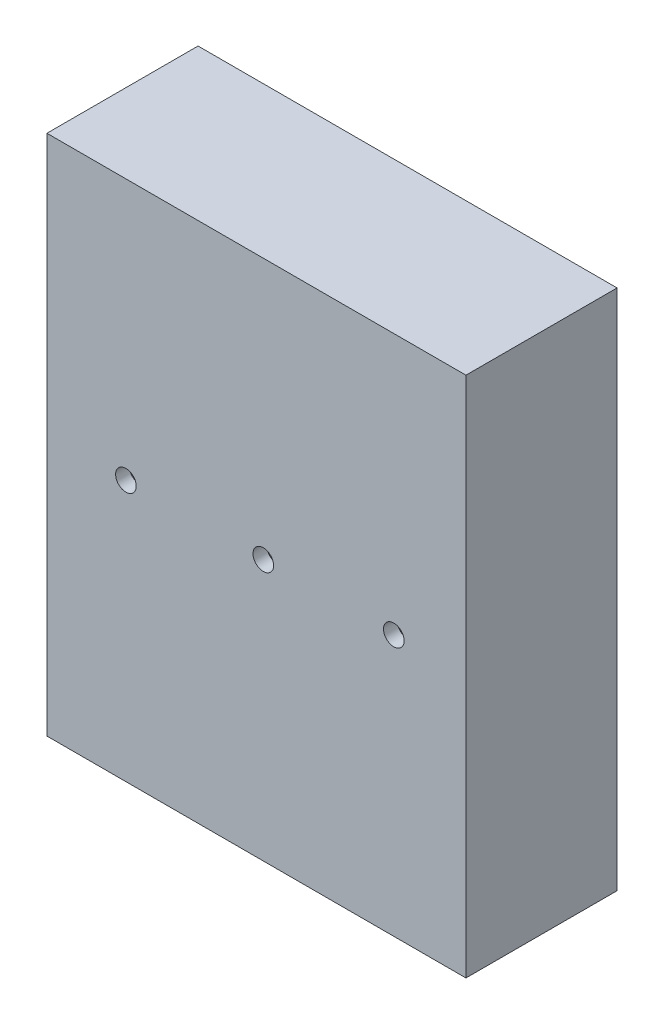
ISO-10303-21;
HEADER;
FILE_DESCRIPTION(('STEP AP214'),'2;1');
FILE_NAME('part.step','',(''),(''),'','','');
FILE_SCHEMA(('AUTOMOTIVE_DESIGN { 1 0 10303 214 1 1 1 1 }'));
ENDSEC;
DATA;
#1=APPLICATION_CONTEXT('core data for automotive mechanical design processes');
#2=APPLICATION_PROTOCOL_DEFINITION('international standard','automotive_design',2000,#1);
#3=PRODUCT_CONTEXT('',#1,'mechanical');
#4=PRODUCT('Part','Part','',(#3));
#5=PRODUCT_RELATED_PRODUCT_CATEGORY('part','',(#4));
#6=PRODUCT_DEFINITION_FORMATION('','',#4);
#7=PRODUCT_DEFINITION_CONTEXT('part definition',#1,'design');
#8=PRODUCT_DEFINITION('design','',#6,#7);
#9=PRODUCT_DEFINITION_SHAPE('','',#8);
#10=(LENGTH_UNIT() NAMED_UNIT(*) SI_UNIT(.MILLI.,.METRE.));
#11=(NAMED_UNIT(*) PLANE_ANGLE_UNIT() SI_UNIT($,.RADIAN.));
#12=(NAMED_UNIT(*) SI_UNIT($,.STERADIAN.) SOLID_ANGLE_UNIT());
#13=UNCERTAINTY_MEASURE_WITH_UNIT(LENGTH_MEASURE(1.E-05),#10,'distance_accuracy_value','');
#14=(GEOMETRIC_REPRESENTATION_CONTEXT(3) GLOBAL_UNCERTAINTY_ASSIGNED_CONTEXT((#13)) GLOBAL_UNIT_ASSIGNED_CONTEXT((#10,
#11,#12)) REPRESENTATION_CONTEXT('',''));
#15=CARTESIAN_POINT('',(0.,0.,0.));
#16=DIRECTION('',(0.,0.,1.));
#17=DIRECTION('',(1.,0.,0.));
#18=AXIS2_PLACEMENT_3D('',#15,#16,#17);
#19=CARTESIAN_POINT('',(0.,0.,20.));
#20=DIRECTION('',(0.,1.,0.));
#21=DIRECTION('',(0.,0.,1.));
#22=AXIS2_PLACEMENT_3D('',#19,#20,#21);
#23=PLANE('',#22);
#24=DIRECTION('',(-1.,0.,0.));
#25=VECTOR('',#24,1.);
#26=CARTESIAN_POINT('',(0.,0.,22.));
#27=LINE('',#26,#25);
#28=CARTESIAN_POINT('',(61.,0.,22.));
#29=VERTEX_POINT('',#28);
#30=CARTESIAN_POINT('',(0.,0.,22.));
#31=VERTEX_POINT('',#30);
#32=EDGE_CURVE('E182',#29,#31,#27,.T.);
#33=ORIENTED_EDGE('',*,*,#32,.F.);
#34=DIRECTION('',(0.,0.,-1.));
#35=VECTOR('',#34,1.);
#36=CARTESIAN_POINT('',(61.,0.,20.));
#37=LINE('',#36,#35);
#38=CARTESIAN_POINT('',(61.,0.,0.));
#39=VERTEX_POINT('',#38);
#40=EDGE_CURVE('E61',#29,#39,#37,.T.);
#41=ORIENTED_EDGE('',*,*,#40,.T.);
#42=DIRECTION('',(1.,0.,0.));
#43=VECTOR('',#42,1.);
#44=CARTESIAN_POINT('',(0.,0.,0.));
#45=LINE('',#44,#43);
#46=CARTESIAN_POINT('',(0.,0.,0.));
#47=VERTEX_POINT('',#46);
#48=EDGE_CURVE('E241',#47,#39,#45,.T.);
#49=ORIENTED_EDGE('',*,*,#48,.F.);
#50=DIRECTION('',(0.,0.,-1.));
#51=VECTOR('',#50,1.);
#52=CARTESIAN_POINT('',(0.,0.,20.));
#53=LINE('',#52,#51);
#54=EDGE_CURVE('E12',#31,#47,#53,.T.);
#55=ORIENTED_EDGE('',*,*,#54,.F.);
#56=EDGE_LOOP('',(#33,#41,#49,#55));
#57=FACE_BOUND('',#56,.T.);
#58=ADVANCED_FACE('F44',(#57),#23,.T.);
#59=CARTESIAN_POINT('',(0.,-76.,20.));
#60=DIRECTION('',(0.,1.,0.));
#61=DIRECTION('',(0.,0.,1.));
#62=AXIS2_PLACEMENT_3D('',#59,#60,#61);
#63=PLANE('',#62);
#64=DIRECTION('',(0.,0.,-1.));
#65=VECTOR('',#64,1.);
#66=CARTESIAN_POINT('',(61.,-76.,20.));
#67=LINE('',#66,#65);
#68=CARTESIAN_POINT('',(61.,-76.,22.));
#69=VERTEX_POINT('',#68);
#70=CARTESIAN_POINT('',(61.,-76.,0.));
#71=VERTEX_POINT('',#70);
#72=EDGE_CURVE('E168',#69,#71,#67,.T.);
#73=ORIENTED_EDGE('',*,*,#72,.F.);
#74=DIRECTION('',(1.,0.,0.));
#75=VECTOR('',#74,1.);
#76=CARTESIAN_POINT('',(0.,-76.,22.));
#77=LINE('',#76,#75);
#78=CARTESIAN_POINT('',(0.,-76.,22.));
#79=VERTEX_POINT('',#78);
#80=EDGE_CURVE('E176',#79,#69,#77,.T.);
#81=ORIENTED_EDGE('',*,*,#80,.F.);
#82=DIRECTION('',(0.,0.,-1.));
#83=VECTOR('',#82,1.);
#84=CARTESIAN_POINT('',(0.,-76.,20.));
#85=LINE('',#84,#83);
#86=CARTESIAN_POINT('',(0.,-76.,0.));
#87=VERTEX_POINT('',#86);
#88=EDGE_CURVE('E53',#79,#87,#85,.T.);
#89=ORIENTED_EDGE('',*,*,#88,.T.);
#90=DIRECTION('',(1.,0.,0.));
#91=VECTOR('',#90,1.);
#92=CARTESIAN_POINT('',(0.,-76.,0.));
#93=LINE('',#92,#91);
#94=EDGE_CURVE('E121',#87,#71,#93,.T.);
#95=ORIENTED_EDGE('',*,*,#94,.T.);
#96=EDGE_LOOP('',(#73,#81,#89,#95));
#97=FACE_BOUND('',#96,.T.);
#98=ADVANCED_FACE('F175',(#97),#63,.F.);
#99=CARTESIAN_POINT('',(0.,0.,0.));
#100=DIRECTION('',(0.,0.,1.));
#101=DIRECTION('',(1.,0.,0.));
#102=AXIS2_PLACEMENT_3D('',#99,#100,#101);
#103=PLANE('',#102);
#104=DIRECTION('',(1.,0.,0.));
#105=VECTOR('',#104,1.);
#106=CARTESIAN_POINT('',(0.,-3.,0.));
#107=LINE('',#106,#105);
#108=CARTESIAN_POINT('',(3.,-3.,0.));
#109=VERTEX_POINT('',#108);
#110=CARTESIAN_POINT('',(20.,-3.,0.));
#111=VERTEX_POINT('',#110);
#112=EDGE_CURVE('E218',#109,#111,#107,.T.);
#113=ORIENTED_EDGE('',*,*,#112,.F.);
#114=DIRECTION('',(0.,-1.,0.));
#115=VECTOR('',#114,1.);
#116=CARTESIAN_POINT('',(3.,0.,0.));
#117=LINE('',#116,#115);
#118=CARTESIAN_POINT('',(3.,-73.,0.));
#119=VERTEX_POINT('',#118);
#120=EDGE_CURVE('E238',#109,#119,#117,.T.);
#121=ORIENTED_EDGE('',*,*,#120,.T.);
#122=DIRECTION('',(1.,0.,0.));
#123=VECTOR('',#122,1.);
#124=CARTESIAN_POINT('',(0.,-73.,0.));
#125=LINE('',#124,#123);
#126=CARTESIAN_POINT('',(20.,-73.,0.));
#127=VERTEX_POINT('',#126);
#128=EDGE_CURVE('E226',#119,#127,#125,.T.);
#129=ORIENTED_EDGE('',*,*,#128,.T.);
#130=DIRECTION('',(0.,-1.,0.));
#131=VECTOR('',#130,1.);
#132=CARTESIAN_POINT('',(20.,0.,0.));
#133=LINE('',#132,#131);
#134=EDGE_CURVE('E235',#111,#127,#133,.T.);
#135=ORIENTED_EDGE('',*,*,#134,.F.);
#136=EDGE_LOOP('',(#113,#121,#129,#135));
#137=FACE_BOUND('',#136,.T.);
#138=DIRECTION('',(0.,-1.,0.));
#139=VECTOR('',#138,1.);
#140=CARTESIAN_POINT('',(23.,0.,0.));
#141=LINE('',#140,#139);
#142=CARTESIAN_POINT('',(23.,-3.,0.));
#143=VERTEX_POINT('',#142);
#144=CARTESIAN_POINT('',(23.,-73.,0.));
#145=VERTEX_POINT('',#144);
#146=EDGE_CURVE('E229',#143,#145,#141,.T.);
#147=ORIENTED_EDGE('',*,*,#146,.T.);
#148=CARTESIAN_POINT('',(40.,-73.,0.));
#149=VERTEX_POINT('',#148);
#150=EDGE_CURVE('E227',#145,#149,#125,.T.);
#151=ORIENTED_EDGE('',*,*,#150,.T.);
#152=DIRECTION('',(0.,-1.,0.));
#153=VECTOR('',#152,1.);
#154=CARTESIAN_POINT('',(40.,0.,0.));
#155=LINE('',#154,#153);
#156=CARTESIAN_POINT('',(40.,-3.,0.));
#157=VERTEX_POINT('',#156);
#158=EDGE_CURVE('E232',#157,#149,#155,.T.);
#159=ORIENTED_EDGE('',*,*,#158,.F.);
#160=EDGE_CURVE('E219',#143,#157,#107,.T.);
#161=ORIENTED_EDGE('',*,*,#160,.F.);
#162=EDGE_LOOP('',(#147,#151,#159,#161));
#163=FACE_BOUND('',#162,.T.);
#164=DIRECTION('',(0.,-1.,0.));
#165=VECTOR('',#164,1.);
#166=CARTESIAN_POINT('',(43.,0.,0.));
#167=LINE('',#166,#165);
#168=CARTESIAN_POINT('',(43.,-3.,0.));
#169=VERTEX_POINT('',#168);
#170=CARTESIAN_POINT('',(43.,-73.,0.));
#171=VERTEX_POINT('',#170);
#172=EDGE_CURVE('E184',#169,#171,#167,.T.);
#173=ORIENTED_EDGE('',*,*,#172,.T.);
#174=CARTESIAN_POINT('',(58.,-73.,0.));
#175=VERTEX_POINT('',#174);
#176=EDGE_CURVE('E222',#171,#175,#125,.T.);
#177=ORIENTED_EDGE('',*,*,#176,.T.);
#178=DIRECTION('',(0.,-1.,0.));
#179=VECTOR('',#178,1.);
#180=CARTESIAN_POINT('',(58.,0.,0.));
#181=LINE('',#180,#179);
#182=CARTESIAN_POINT('',(58.,-3.,0.));
#183=VERTEX_POINT('',#182);
#184=EDGE_CURVE('E217',#183,#175,#181,.T.);
#185=ORIENTED_EDGE('',*,*,#184,.F.);
#186=EDGE_CURVE('E215',#169,#183,#107,.T.);
#187=ORIENTED_EDGE('',*,*,#186,.F.);
#188=EDGE_LOOP('',(#173,#177,#185,#187));
#189=FACE_BOUND('',#188,.T.);
#190=DIRECTION('',(0.,-1.,0.));
#191=VECTOR('',#190,1.);
#192=CARTESIAN_POINT('',(61.,0.,0.));
#193=LINE('',#192,#191);
#194=EDGE_CURVE('E225',#39,#71,#193,.T.);
#195=ORIENTED_EDGE('',*,*,#194,.T.);
#196=ORIENTED_EDGE('',*,*,#94,.F.);
#197=DIRECTION('',(0.,-1.,0.));
#198=VECTOR('',#197,1.);
#199=CARTESIAN_POINT('',(0.,0.,0.));
#200=LINE('',#199,#198);
#201=EDGE_CURVE('E244',#47,#87,#200,.T.);
#202=ORIENTED_EDGE('',*,*,#201,.F.);
#203=ORIENTED_EDGE('',*,*,#48,.T.);
#204=EDGE_LOOP('',(#195,#196,#202,#203));
#205=FACE_BOUND('',#204,.T.);
#206=ADVANCED_FACE('F282',(#137,#163,#189,#205),#103,.F.);
#207=CARTESIAN_POINT('',(0.,0.,22.));
#208=DIRECTION('',(0.,0.,1.));
#209=DIRECTION('',(1.,0.,0.));
#210=AXIS2_PLACEMENT_3D('',#207,#208,#209);
#211=PLANE('',#210);
#212=CARTESIAN_POINT('',(11.5,-38.,22.));
#213=DIRECTION('',(0.,0.,-1.));
#214=DIRECTION('',(-1.,0.,0.));
#215=AXIS2_PLACEMENT_3D('',#212,#213,#214);
#216=CIRCLE('',#215,1.5);
#217=CARTESIAN_POINT('',(10.,-38.,22.));
#218=VERTEX_POINT('',#217);
#219=EDGE_CURVE('E570',#218,#218,#216,.T.);
#220=ORIENTED_EDGE('',*,*,#219,.T.);
#221=EDGE_LOOP('',(#220));
#222=FACE_BOUND('',#221,.T.);
#223=CARTESIAN_POINT('',(31.5,-38.,22.));
#224=DIRECTION('',(0.,0.,-1.));
#225=DIRECTION('',(-1.,0.,0.));
#226=AXIS2_PLACEMENT_3D('',#223,#224,#225);
#227=CIRCLE('',#226,1.5);
#228=CARTESIAN_POINT('',(30.,-38.,22.));
#229=VERTEX_POINT('',#228);
#230=EDGE_CURVE('E583',#229,#229,#227,.T.);
#231=ORIENTED_EDGE('',*,*,#230,.T.);
#232=EDGE_LOOP('',(#231));
#233=FACE_BOUND('',#232,.T.);
#234=CARTESIAN_POINT('',(50.5,-38.,22.));
#235=DIRECTION('',(0.,0.,-1.));
#236=DIRECTION('',(-1.,0.,0.));
#237=AXIS2_PLACEMENT_3D('',#234,#235,#236);
#238=CIRCLE('',#237,1.5);
#239=CARTESIAN_POINT('',(49.,-38.,22.));
#240=VERTEX_POINT('',#239);
#241=EDGE_CURVE('E577',#240,#240,#238,.T.);
#242=ORIENTED_EDGE('',*,*,#241,.T.);
#243=EDGE_LOOP('',(#242));
#244=FACE_BOUND('',#243,.T.);
#245=ORIENTED_EDGE('',*,*,#80,.T.);
#246=DIRECTION('',(0.,-1.,0.));
#247=VECTOR('',#246,1.);
#248=CARTESIAN_POINT('',(61.,0.,22.));
#249=LINE('',#248,#247);
#250=EDGE_CURVE('E165',#29,#69,#249,.T.);
#251=ORIENTED_EDGE('',*,*,#250,.F.);
#252=ORIENTED_EDGE('',*,*,#32,.T.);
#253=DIRECTION('',(0.,-1.,0.));
#254=VECTOR('',#253,1.);
#255=CARTESIAN_POINT('',(0.,0.,22.));
#256=LINE('',#255,#254);
#257=EDGE_CURVE('E181',#31,#79,#256,.T.);
#258=ORIENTED_EDGE('',*,*,#257,.T.);
#259=EDGE_LOOP('',(#245,#251,#252,#258));
#260=FACE_BOUND('',#259,.T.);
#261=ADVANCED_FACE('F179',(#222,#233,#244,#260),#211,.T.);
#262=CARTESIAN_POINT('',(0.,0.,20.));
#263=DIRECTION('',(1.,0.,0.));
#264=DIRECTION('',(0.,1.,0.));
#265=AXIS2_PLACEMENT_3D('',#262,#263,#264);
#266=PLANE('',#265);
#267=ORIENTED_EDGE('',*,*,#201,.T.);
#268=ORIENTED_EDGE('',*,*,#88,.F.);
#269=ORIENTED_EDGE('',*,*,#257,.F.);
#270=ORIENTED_EDGE('',*,*,#54,.T.);
#271=EDGE_LOOP('',(#267,#268,#269,#270));
#272=FACE_BOUND('',#271,.T.);
#273=ADVANCED_FACE('F310',(#272),#266,.F.);
#274=CARTESIAN_POINT('',(0.,-3.,20.));
#275=DIRECTION('',(0.,1.,0.));
#276=DIRECTION('',(0.,0.,1.));
#277=AXIS2_PLACEMENT_3D('',#274,#275,#276);
#278=PLANE('',#277);
#279=ORIENTED_EDGE('',*,*,#112,.T.);
#280=DIRECTION('',(0.,0.,-1.));
#281=VECTOR('',#280,1.);
#282=CARTESIAN_POINT('',(20.,-3.,20.));
#283=LINE('',#282,#281);
#284=CARTESIAN_POINT('',(20.,-3.,20.));
#285=VERTEX_POINT('',#284);
#286=EDGE_CURVE('E248',#285,#111,#283,.T.);
#287=ORIENTED_EDGE('',*,*,#286,.F.);
#288=DIRECTION('',(1.,0.,0.));
#289=VECTOR('',#288,1.);
#290=CARTESIAN_POINT('',(0.,-3.,20.));
#291=LINE('',#290,#289);
#292=CARTESIAN_POINT('',(3.,-3.,20.));
#293=VERTEX_POINT('',#292);
#294=EDGE_CURVE('E195',#293,#285,#291,.T.);
#295=ORIENTED_EDGE('',*,*,#294,.F.);
#296=DIRECTION('',(0.,0.,-1.));
#297=VECTOR('',#296,1.);
#298=CARTESIAN_POINT('',(3.,-3.,20.));
#299=LINE('',#298,#297);
#300=EDGE_CURVE('E250',#293,#109,#299,.T.);
#301=ORIENTED_EDGE('',*,*,#300,.T.);
#302=EDGE_LOOP('',(#279,#287,#295,#301));
#303=FACE_BOUND('',#302,.T.);
#304=ADVANCED_FACE('F299',(#303),#278,.F.);
#305=CARTESIAN_POINT('',(20.,0.,20.));
#306=DIRECTION('',(1.,0.,0.));
#307=DIRECTION('',(0.,0.,-1.));
#308=AXIS2_PLACEMENT_3D('',#305,#306,#307);
#309=PLANE('',#308);
#310=ORIENTED_EDGE('',*,*,#134,.T.);
#311=DIRECTION('',(0.,0.,-1.));
#312=VECTOR('',#311,1.);
#313=CARTESIAN_POINT('',(20.,-73.,20.));
#314=LINE('',#313,#312);
#315=CARTESIAN_POINT('',(20.,-73.,20.));
#316=VERTEX_POINT('',#315);
#317=EDGE_CURVE('E255',#316,#127,#314,.T.);
#318=ORIENTED_EDGE('',*,*,#317,.F.);
#319=DIRECTION('',(0.,-1.,0.));
#320=VECTOR('',#319,1.);
#321=CARTESIAN_POINT('',(20.,0.,20.));
#322=LINE('',#321,#320);
#323=EDGE_CURVE('E207',#285,#316,#322,.T.);
#324=ORIENTED_EDGE('',*,*,#323,.F.);
#325=ORIENTED_EDGE('',*,*,#286,.T.);
#326=EDGE_LOOP('',(#310,#318,#324,#325));
#327=FACE_BOUND('',#326,.T.);
#328=ADVANCED_FACE('F316',(#327),#309,.F.);
#329=CARTESIAN_POINT('',(0.,-73.,20.));
#330=DIRECTION('',(0.,1.,0.));
#331=DIRECTION('',(0.,0.,1.));
#332=AXIS2_PLACEMENT_3D('',#329,#330,#331);
#333=PLANE('',#332);
#334=ORIENTED_EDGE('',*,*,#128,.F.);
#335=DIRECTION('',(0.,0.,-1.));
#336=VECTOR('',#335,1.);
#337=CARTESIAN_POINT('',(3.,-73.,20.));
#338=LINE('',#337,#336);
#339=CARTESIAN_POINT('',(3.,-73.,20.));
#340=VERTEX_POINT('',#339);
#341=EDGE_CURVE('E252',#340,#119,#338,.T.);
#342=ORIENTED_EDGE('',*,*,#341,.F.);
#343=DIRECTION('',(1.,0.,0.));
#344=VECTOR('',#343,1.);
#345=CARTESIAN_POINT('',(0.,-73.,20.));
#346=LINE('',#345,#344);
#347=EDGE_CURVE('E70',#340,#316,#346,.T.);
#348=ORIENTED_EDGE('',*,*,#347,.T.);
#349=ORIENTED_EDGE('',*,*,#317,.T.);
#350=EDGE_LOOP('',(#334,#342,#348,#349));
#351=FACE_BOUND('',#350,.T.);
#352=ADVANCED_FACE('F312',(#351),#333,.T.);
#353=CARTESIAN_POINT('',(23.,0.,20.));
#354=DIRECTION('',(1.,0.,0.));
#355=DIRECTION('',(0.,1.,0.));
#356=AXIS2_PLACEMENT_3D('',#353,#354,#355);
#357=PLANE('',#356);
#358=ORIENTED_EDGE('',*,*,#146,.F.);
#359=DIRECTION('',(0.,0.,-1.));
#360=VECTOR('',#359,1.);
#361=CARTESIAN_POINT('',(23.,-3.,20.));
#362=LINE('',#361,#360);
#363=CARTESIAN_POINT('',(23.,-3.,20.));
#364=VERTEX_POINT('',#363);
#365=EDGE_CURVE('E253',#364,#143,#362,.T.);
#366=ORIENTED_EDGE('',*,*,#365,.F.);
#367=DIRECTION('',(0.,-1.,0.));
#368=VECTOR('',#367,1.);
#369=CARTESIAN_POINT('',(23.,0.,20.));
#370=LINE('',#369,#368);
#371=CARTESIAN_POINT('',(23.,-73.,20.));
#372=VERTEX_POINT('',#371);
#373=EDGE_CURVE('E201',#364,#372,#370,.T.);
#374=ORIENTED_EDGE('',*,*,#373,.T.);
#375=DIRECTION('',(0.,0.,-1.));
#376=VECTOR('',#375,1.);
#377=CARTESIAN_POINT('',(23.,-73.,20.));
#378=LINE('',#377,#376);
#379=EDGE_CURVE('E259',#372,#145,#378,.T.);
#380=ORIENTED_EDGE('',*,*,#379,.T.);
#381=EDGE_LOOP('',(#358,#366,#374,#380));
#382=FACE_BOUND('',#381,.T.);
#383=ADVANCED_FACE('F315',(#382),#357,.T.);
#384=ORIENTED_EDGE('',*,*,#160,.T.);
#385=DIRECTION('',(0.,0.,-1.));
#386=VECTOR('',#385,1.);
#387=CARTESIAN_POINT('',(40.,-3.,20.));
#388=LINE('',#387,#386);
#389=CARTESIAN_POINT('',(40.,-3.,20.));
#390=VERTEX_POINT('',#389);
#391=EDGE_CURVE('E263',#390,#157,#388,.T.);
#392=ORIENTED_EDGE('',*,*,#391,.F.);
#393=EDGE_CURVE('E196',#364,#390,#291,.T.);
#394=ORIENTED_EDGE('',*,*,#393,.F.);
#395=ORIENTED_EDGE('',*,*,#365,.T.);
#396=EDGE_LOOP('',(#384,#392,#394,#395));
#397=FACE_BOUND('',#396,.T.);
#398=ADVANCED_FACE('F298',(#397),#278,.F.);
#399=CARTESIAN_POINT('',(40.,0.,20.));
#400=DIRECTION('',(1.,0.,0.));
#401=DIRECTION('',(0.,0.,-1.));
#402=AXIS2_PLACEMENT_3D('',#399,#400,#401);
#403=PLANE('',#402);
#404=ORIENTED_EDGE('',*,*,#158,.T.);
#405=DIRECTION('',(0.,0.,-1.));
#406=VECTOR('',#405,1.);
#407=CARTESIAN_POINT('',(40.,-73.,20.));
#408=LINE('',#407,#406);
#409=CARTESIAN_POINT('',(40.,-73.,20.));
#410=VERTEX_POINT('',#409);
#411=EDGE_CURVE('E261',#410,#149,#408,.T.);
#412=ORIENTED_EDGE('',*,*,#411,.F.);
#413=DIRECTION('',(0.,-1.,0.));
#414=VECTOR('',#413,1.);
#415=CARTESIAN_POINT('',(40.,0.,20.));
#416=LINE('',#415,#414);
#417=EDGE_CURVE('E205',#390,#410,#416,.T.);
#418=ORIENTED_EDGE('',*,*,#417,.F.);
#419=ORIENTED_EDGE('',*,*,#391,.T.);
#420=EDGE_LOOP('',(#404,#412,#418,#419));
#421=FACE_BOUND('',#420,.T.);
#422=ADVANCED_FACE('F323',(#421),#403,.F.);
#423=CARTESIAN_POINT('',(61.,0.,20.));
#424=DIRECTION('',(1.,0.,0.));
#425=DIRECTION('',(0.,0.,-1.));
#426=AXIS2_PLACEMENT_3D('',#423,#424,#425);
#427=PLANE('',#426);
#428=ORIENTED_EDGE('',*,*,#194,.F.);
#429=ORIENTED_EDGE('',*,*,#40,.F.);
#430=ORIENTED_EDGE('',*,*,#250,.T.);
#431=ORIENTED_EDGE('',*,*,#72,.T.);
#432=EDGE_LOOP('',(#428,#429,#430,#431));
#433=FACE_BOUND('',#432,.T.);
#434=ADVANCED_FACE('F167',(#433),#427,.T.);
#435=CARTESIAN_POINT('',(43.,0.,20.));
#436=DIRECTION('',(1.,0.,0.));
#437=DIRECTION('',(0.,1.,0.));
#438=AXIS2_PLACEMENT_3D('',#435,#436,#437);
#439=PLANE('',#438);
#440=ORIENTED_EDGE('',*,*,#172,.F.);
#441=DIRECTION('',(0.,0.,-1.));
#442=VECTOR('',#441,1.);
#443=CARTESIAN_POINT('',(43.,-3.,20.));
#444=LINE('',#443,#442);
#445=CARTESIAN_POINT('',(43.,-3.,20.));
#446=VERTEX_POINT('',#445);
#447=EDGE_CURVE('E48',#446,#169,#444,.T.);
#448=ORIENTED_EDGE('',*,*,#447,.F.);
#449=DIRECTION('',(0.,-1.,0.));
#450=VECTOR('',#449,1.);
#451=CARTESIAN_POINT('',(43.,0.,20.));
#452=LINE('',#451,#450);
#453=CARTESIAN_POINT('',(43.,-73.,20.));
#454=VERTEX_POINT('',#453);
#455=EDGE_CURVE('E190',#446,#454,#452,.T.);
#456=ORIENTED_EDGE('',*,*,#455,.T.);
#457=DIRECTION('',(0.,0.,-1.));
#458=VECTOR('',#457,1.);
#459=CARTESIAN_POINT('',(43.,-73.,20.));
#460=LINE('',#459,#458);
#461=EDGE_CURVE('E212',#454,#171,#460,.T.);
#462=ORIENTED_EDGE('',*,*,#461,.T.);
#463=EDGE_LOOP('',(#440,#448,#456,#462));
#464=FACE_BOUND('',#463,.T.);
#465=ADVANCED_FACE('F46',(#464),#439,.T.);
#466=ORIENTED_EDGE('',*,*,#186,.T.);
#467=DIRECTION('',(0.,0.,-1.));
#468=VECTOR('',#467,1.);
#469=CARTESIAN_POINT('',(58.,-3.,20.));
#470=LINE('',#469,#468);
#471=CARTESIAN_POINT('',(58.,-3.,20.));
#472=VERTEX_POINT('',#471);
#473=EDGE_CURVE('E269',#472,#183,#470,.T.);
#474=ORIENTED_EDGE('',*,*,#473,.F.);
#475=EDGE_CURVE('E193',#446,#472,#291,.T.);
#476=ORIENTED_EDGE('',*,*,#475,.F.);
#477=ORIENTED_EDGE('',*,*,#447,.T.);
#478=EDGE_LOOP('',(#466,#474,#476,#477));
#479=FACE_BOUND('',#478,.T.);
#480=ADVANCED_FACE('F278',(#479),#278,.F.);
#481=CARTESIAN_POINT('',(58.,0.,20.));
#482=DIRECTION('',(1.,0.,0.));
#483=DIRECTION('',(0.,1.,0.));
#484=AXIS2_PLACEMENT_3D('',#481,#482,#483);
#485=PLANE('',#484);
#486=ORIENTED_EDGE('',*,*,#184,.T.);
#487=DIRECTION('',(0.,0.,-1.));
#488=VECTOR('',#487,1.);
#489=CARTESIAN_POINT('',(58.,-73.,20.));
#490=LINE('',#489,#488);
#491=CARTESIAN_POINT('',(58.,-73.,20.));
#492=VERTEX_POINT('',#491);
#493=EDGE_CURVE('E268',#492,#175,#490,.T.);
#494=ORIENTED_EDGE('',*,*,#493,.F.);
#495=DIRECTION('',(0.,-1.,0.));
#496=VECTOR('',#495,1.);
#497=CARTESIAN_POINT('',(58.,0.,20.));
#498=LINE('',#497,#496);
#499=EDGE_CURVE('E128',#472,#492,#498,.T.);
#500=ORIENTED_EDGE('',*,*,#499,.F.);
#501=ORIENTED_EDGE('',*,*,#473,.T.);
#502=EDGE_LOOP('',(#486,#494,#500,#501));
#503=FACE_BOUND('',#502,.T.);
#504=ADVANCED_FACE('F287',(#503),#485,.F.);
#505=CARTESIAN_POINT('',(3.,0.,20.));
#506=DIRECTION('',(1.,0.,0.));
#507=DIRECTION('',(0.,0.,-1.));
#508=AXIS2_PLACEMENT_3D('',#505,#506,#507);
#509=PLANE('',#508);
#510=ORIENTED_EDGE('',*,*,#120,.F.);
#511=ORIENTED_EDGE('',*,*,#300,.F.);
#512=DIRECTION('',(0.,-1.,0.));
#513=VECTOR('',#512,1.);
#514=CARTESIAN_POINT('',(3.,0.,20.));
#515=LINE('',#514,#513);
#516=EDGE_CURVE('E209',#293,#340,#515,.T.);
#517=ORIENTED_EDGE('',*,*,#516,.T.);
#518=ORIENTED_EDGE('',*,*,#341,.T.);
#519=EDGE_LOOP('',(#510,#511,#517,#518));
#520=FACE_BOUND('',#519,.T.);
#521=ADVANCED_FACE('F289',(#520),#509,.T.);
#522=ORIENTED_EDGE('',*,*,#150,.F.);
#523=ORIENTED_EDGE('',*,*,#379,.F.);
#524=EDGE_CURVE('E202',#372,#410,#346,.T.);
#525=ORIENTED_EDGE('',*,*,#524,.T.);
#526=ORIENTED_EDGE('',*,*,#411,.T.);
#527=EDGE_LOOP('',(#522,#523,#525,#526));
#528=FACE_BOUND('',#527,.T.);
#529=ADVANCED_FACE('F294',(#528),#333,.T.);
#530=ORIENTED_EDGE('',*,*,#176,.F.);
#531=ORIENTED_EDGE('',*,*,#461,.F.);
#532=EDGE_CURVE('E198',#454,#492,#346,.T.);
#533=ORIENTED_EDGE('',*,*,#532,.T.);
#534=ORIENTED_EDGE('',*,*,#493,.T.);
#535=EDGE_LOOP('',(#530,#531,#533,#534));
#536=FACE_BOUND('',#535,.T.);
#537=ADVANCED_FACE('F286',(#536),#333,.T.);
#538=CARTESIAN_POINT('',(0.,0.,20.));
#539=DIRECTION('',(0.,0.,1.));
#540=DIRECTION('',(1.,0.,0.));
#541=AXIS2_PLACEMENT_3D('',#538,#539,#540);
#542=PLANE('',#541);
#543=CARTESIAN_POINT('',(11.5,-38.,20.));
#544=DIRECTION('',(0.,0.,-1.));
#545=DIRECTION('',(-1.,0.,0.));
#546=AXIS2_PLACEMENT_3D('',#543,#544,#545);
#547=CIRCLE('',#546,1.5);
#548=CARTESIAN_POINT('',(10.,-38.,20.));
#549=VERTEX_POINT('',#548);
#550=EDGE_CURVE('E573',#549,#549,#547,.T.);
#551=ORIENTED_EDGE('',*,*,#550,.F.);
#552=EDGE_LOOP('',(#551));
#553=FACE_BOUND('',#552,.T.);
#554=ORIENTED_EDGE('',*,*,#516,.F.);
#555=ORIENTED_EDGE('',*,*,#294,.T.);
#556=ORIENTED_EDGE('',*,*,#323,.T.);
#557=ORIENTED_EDGE('',*,*,#347,.F.);
#558=EDGE_LOOP('',(#554,#555,#556,#557));
#559=FACE_BOUND('',#558,.T.);
#560=ADVANCED_FACE('F375',(#553,#559),#542,.F.);
#561=CARTESIAN_POINT('',(31.5,-38.,20.));
#562=DIRECTION('',(0.,0.,-1.));
#563=DIRECTION('',(-1.,0.,0.));
#564=AXIS2_PLACEMENT_3D('',#561,#562,#563);
#565=CIRCLE('',#564,1.5);
#566=CARTESIAN_POINT('',(30.,-38.,20.));
#567=VERTEX_POINT('',#566);
#568=EDGE_CURVE('E580',#567,#567,#565,.T.);
#569=ORIENTED_EDGE('',*,*,#568,.F.);
#570=EDGE_LOOP('',(#569));
#571=FACE_BOUND('',#570,.T.);
#572=ORIENTED_EDGE('',*,*,#373,.F.);
#573=ORIENTED_EDGE('',*,*,#393,.T.);
#574=ORIENTED_EDGE('',*,*,#417,.T.);
#575=ORIENTED_EDGE('',*,*,#524,.F.);
#576=EDGE_LOOP('',(#572,#573,#574,#575));
#577=FACE_BOUND('',#576,.T.);
#578=ADVANCED_FACE('F385',(#571,#577),#542,.F.);
#579=CARTESIAN_POINT('',(50.5,-38.,20.));
#580=DIRECTION('',(0.,0.,-1.));
#581=DIRECTION('',(-1.,0.,0.));
#582=AXIS2_PLACEMENT_3D('',#579,#580,#581);
#583=CIRCLE('',#582,1.5);
#584=CARTESIAN_POINT('',(49.,-38.,20.));
#585=VERTEX_POINT('',#584);
#586=EDGE_CURVE('E186',#585,#585,#583,.T.);
#587=ORIENTED_EDGE('',*,*,#586,.F.);
#588=EDGE_LOOP('',(#587));
#589=FACE_BOUND('',#588,.T.);
#590=ORIENTED_EDGE('',*,*,#455,.F.);
#591=ORIENTED_EDGE('',*,*,#475,.T.);
#592=ORIENTED_EDGE('',*,*,#499,.T.);
#593=ORIENTED_EDGE('',*,*,#532,.F.);
#594=EDGE_LOOP('',(#590,#591,#592,#593));
#595=FACE_BOUND('',#594,.T.);
#596=ADVANCED_FACE('F388',(#589,#595),#542,.F.);
#597=CARTESIAN_POINT('',(11.5,-38.,22.));
#598=DIRECTION('',(0.,0.,-1.));
#599=DIRECTION('',(-1.,0.,0.));
#600=AXIS2_PLACEMENT_3D('',#597,#598,#599);
#601=CYLINDRICAL_SURFACE('',#600,1.5);
#602=ORIENTED_EDGE('',*,*,#550,.T.);
#603=EDGE_LOOP('',(#602));
#604=FACE_BOUND('',#603,.T.);
#605=ORIENTED_EDGE('',*,*,#219,.F.);
#606=EDGE_LOOP('',(#605));
#607=FACE_BOUND('',#606,.T.);
#608=ADVANCED_FACE('F404',(#604,#607),#601,.F.);
#609=CARTESIAN_POINT('',(31.5,-38.,22.));
#610=DIRECTION('',(0.,0.,-1.));
#611=DIRECTION('',(-1.,0.,0.));
#612=AXIS2_PLACEMENT_3D('',#609,#610,#611);
#613=CYLINDRICAL_SURFACE('',#612,1.5);
#614=ORIENTED_EDGE('',*,*,#230,.F.);
#615=EDGE_LOOP('',(#614));
#616=FACE_BOUND('',#615,.T.);
#617=ORIENTED_EDGE('',*,*,#568,.T.);
#618=EDGE_LOOP('',(#617));
#619=FACE_BOUND('',#618,.T.);
#620=ADVANCED_FACE('F414',(#616,#619),#613,.F.);
#621=CARTESIAN_POINT('',(50.5,-38.,22.));
#622=DIRECTION('',(0.,0.,-1.));
#623=DIRECTION('',(-1.,0.,0.));
#624=AXIS2_PLACEMENT_3D('',#621,#622,#623);
#625=CYLINDRICAL_SURFACE('',#624,1.5);
#626=ORIENTED_EDGE('',*,*,#241,.F.);
#627=EDGE_LOOP('',(#626));
#628=FACE_BOUND('',#627,.T.);
#629=ORIENTED_EDGE('',*,*,#586,.T.);
#630=EDGE_LOOP('',(#629));
#631=FACE_BOUND('',#630,.T.);
#632=ADVANCED_FACE('F423',(#628,#631),#625,.F.);
#633=CLOSED_SHELL('',(#58,#98,#206,#261,#273,#304,#328,#352,#383,#398,#422,#434,#465,#480,#504,
#521,#529,#537,#560,#578,#596,#608,#620,#632));
#634=MANIFOLD_SOLID_BREP('B2',#633);
#635=ADVANCED_BREP_SHAPE_REPRESENTATION('',(#18,#634),#14);
#636=SHAPE_DEFINITION_REPRESENTATION(#9,#635);
ENDSEC;
END-ISO-10303-21;
